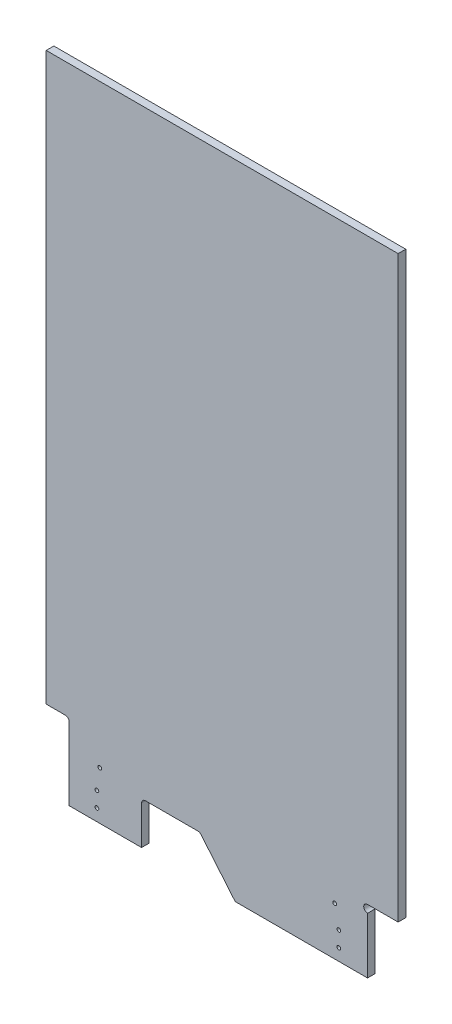
ISO-10303-21;
HEADER;
FILE_DESCRIPTION(('STEP AP214'),'2;1');
FILE_NAME('part.step','',(''),(''),'','','');
FILE_SCHEMA(('AUTOMOTIVE_DESIGN { 1 0 10303 214 1 1 1 1 }'));
ENDSEC;
DATA;
#1=APPLICATION_CONTEXT('core data for automotive mechanical design processes');
#2=APPLICATION_PROTOCOL_DEFINITION('international standard','automotive_design',2000,#1);
#3=PRODUCT_CONTEXT('',#1,'mechanical');
#4=PRODUCT('Part','Part','',(#3));
#5=PRODUCT_RELATED_PRODUCT_CATEGORY('part','',(#4));
#6=PRODUCT_DEFINITION_FORMATION('','',#4);
#7=PRODUCT_DEFINITION_CONTEXT('part definition',#1,'design');
#8=PRODUCT_DEFINITION('design','',#6,#7);
#9=PRODUCT_DEFINITION_SHAPE('','',#8);
#10=(LENGTH_UNIT() NAMED_UNIT(*) SI_UNIT(.MILLI.,.METRE.));
#11=(NAMED_UNIT(*) PLANE_ANGLE_UNIT() SI_UNIT($,.RADIAN.));
#12=(NAMED_UNIT(*) SI_UNIT($,.STERADIAN.) SOLID_ANGLE_UNIT());
#13=UNCERTAINTY_MEASURE_WITH_UNIT(LENGTH_MEASURE(1.E-05),#10,'distance_accuracy_value','');
#14=(GEOMETRIC_REPRESENTATION_CONTEXT(3) GLOBAL_UNCERTAINTY_ASSIGNED_CONTEXT((#13)) GLOBAL_UNIT_ASSIGNED_CONTEXT((#10,
#11,#12)) REPRESENTATION_CONTEXT('',''));
#15=CARTESIAN_POINT('',(0.,0.,0.));
#16=DIRECTION('',(0.,0.,1.));
#17=DIRECTION('',(1.,0.,0.));
#18=AXIS2_PLACEMENT_3D('',#15,#16,#17);
#19=CARTESIAN_POINT('',(0.,0.,-12.7));
#20=DIRECTION('',(0.,-1.,0.));
#21=DIRECTION('',(0.,0.,-1.));
#22=AXIS2_PLACEMENT_3D('',#19,#20,#21);
#23=PLANE('',#22);
#24=DIRECTION('',(0.,0.,1.));
#25=VECTOR('',#24,1.);
#26=CARTESIAN_POINT('',(313.74877856418,0.,-183.341668485135));
#27=LINE('',#26,#25);
#28=CARTESIAN_POINT('',(313.74877856418,0.,-12.7));
#29=VERTEX_POINT('',#28);
#30=CARTESIAN_POINT('',(313.74877856418,0.,0.));
#31=VERTEX_POINT('',#30);
#32=EDGE_CURVE('E189',#29,#31,#27,.T.);
#33=ORIENTED_EDGE('',*,*,#32,.F.);
#34=DIRECTION('',(1.,0.,0.));
#35=VECTOR('',#34,1.);
#36=CARTESIAN_POINT('',(0.,0.,-12.7));
#37=LINE('',#36,#35);
#38=CARTESIAN_POINT('',(533.4,0.,-12.7));
#39=VERTEX_POINT('',#38);
#40=EDGE_CURVE('E169',#29,#39,#37,.T.);
#41=ORIENTED_EDGE('',*,*,#40,.T.);
#42=DIRECTION('',(0.,0.,1.));
#43=VECTOR('',#42,1.);
#44=CARTESIAN_POINT('',(533.4,0.,-132.940834083102));
#45=LINE('',#44,#43);
#46=CARTESIAN_POINT('',(533.4,0.,0.));
#47=VERTEX_POINT('',#46);
#48=EDGE_CURVE('E207',#39,#47,#45,.T.);
#49=ORIENTED_EDGE('',*,*,#48,.T.);
#50=DIRECTION('',(1.,0.,0.));
#51=VECTOR('',#50,1.);
#52=CARTESIAN_POINT('',(0.,0.,0.));
#53=LINE('',#52,#51);
#54=EDGE_CURVE('E298',#31,#47,#53,.T.);
#55=ORIENTED_EDGE('',*,*,#54,.F.);
#56=EDGE_LOOP('',(#33,#41,#49,#55));
#57=FACE_BOUND('',#56,.T.);
#58=ADVANCED_FACE('F31',(#57),#23,.T.);
#59=CARTESIAN_POINT('',(584.2,1066.8,-12.7));
#60=DIRECTION('',(0.,1.,0.));
#61=DIRECTION('',(0.,0.,1.));
#62=AXIS2_PLACEMENT_3D('',#59,#60,#61);
#63=PLANE('',#62);
#64=DIRECTION('',(-1.,0.,0.));
#65=VECTOR('',#64,1.);
#66=CARTESIAN_POINT('',(584.2,1066.8,0.));
#67=LINE('',#66,#65);
#68=CARTESIAN_POINT('',(584.2,1066.8,0.));
#69=VERTEX_POINT('',#68);
#70=CARTESIAN_POINT('',(-1.30641005825771E-13,1066.8,0.));
#71=VERTEX_POINT('',#70);
#72=EDGE_CURVE('E280',#69,#71,#67,.T.);
#73=ORIENTED_EDGE('',*,*,#72,.F.);
#74=DIRECTION('',(0.,0.,1.));
#75=VECTOR('',#74,1.);
#76=CARTESIAN_POINT('',(584.2,1066.8,-12.7));
#77=LINE('',#76,#75);
#78=CARTESIAN_POINT('',(584.2,1066.8,-12.7));
#79=VERTEX_POINT('',#78);
#80=EDGE_CURVE('E11',#79,#69,#77,.T.);
#81=ORIENTED_EDGE('',*,*,#80,.F.);
#82=DIRECTION('',(-1.,0.,0.));
#83=VECTOR('',#82,1.);
#84=CARTESIAN_POINT('',(584.2,1066.8,-12.7));
#85=LINE('',#84,#83);
#86=CARTESIAN_POINT('',(-1.30641005825771E-13,1066.8,-12.7));
#87=VERTEX_POINT('',#86);
#88=EDGE_CURVE('E281',#79,#87,#85,.T.);
#89=ORIENTED_EDGE('',*,*,#88,.T.);
#90=DIRECTION('',(0.,0.,1.));
#91=VECTOR('',#90,1.);
#92=CARTESIAN_POINT('',(-1.30641005825771E-13,1066.8,-12.7));
#93=LINE('',#92,#91);
#94=EDGE_CURVE('E35',#87,#71,#93,.T.);
#95=ORIENTED_EDGE('',*,*,#94,.T.);
#96=EDGE_LOOP('',(#73,#81,#89,#95));
#97=FACE_BOUND('',#96,.T.);
#98=ADVANCED_FACE('F33',(#97),#63,.T.);
#99=CARTESIAN_POINT('',(584.2,0.,-12.7));
#100=DIRECTION('',(1.,0.,0.));
#101=DIRECTION('',(0.,1.,0.));
#102=AXIS2_PLACEMENT_3D('',#99,#100,#101);
#103=PLANE('',#102);
#104=DIRECTION('',(0.,0.,1.));
#105=VECTOR('',#104,1.);
#106=CARTESIAN_POINT('',(584.2,105.791,-132.940834083102));
#107=LINE('',#106,#105);
#108=CARTESIAN_POINT('',(584.2,105.791,-12.7));
#109=VERTEX_POINT('',#108);
#110=CARTESIAN_POINT('',(584.2,105.791,0.));
#111=VERTEX_POINT('',#110);
#112=EDGE_CURVE('E214',#109,#111,#107,.T.);
#113=ORIENTED_EDGE('',*,*,#112,.F.);
#114=DIRECTION('',(0.,1.,0.));
#115=VECTOR('',#114,1.);
#116=CARTESIAN_POINT('',(584.2,0.,-12.7));
#117=LINE('',#116,#115);
#118=EDGE_CURVE('E291',#109,#79,#117,.T.);
#119=ORIENTED_EDGE('',*,*,#118,.T.);
#120=ORIENTED_EDGE('',*,*,#80,.T.);
#121=DIRECTION('',(0.,1.,0.));
#122=VECTOR('',#121,1.);
#123=CARTESIAN_POINT('',(584.2,0.,0.));
#124=LINE('',#123,#122);
#125=EDGE_CURVE('E285',#111,#69,#124,.T.);
#126=ORIENTED_EDGE('',*,*,#125,.F.);
#127=EDGE_LOOP('',(#113,#119,#120,#126));
#128=FACE_BOUND('',#127,.T.);
#129=ADVANCED_FACE('F310',(#128),#103,.T.);
#130=DIRECTION('',(0.,0.,1.));
#131=VECTOR('',#130,1.);
#132=CARTESIAN_POINT('',(158.32633710844,0.,-183.341668485135));
#133=LINE('',#132,#131);
#134=CARTESIAN_POINT('',(158.32633710844,0.,-12.7));
#135=VERTEX_POINT('',#134);
#136=CARTESIAN_POINT('',(158.32633710844,0.,0.));
#137=VERTEX_POINT('',#136);
#138=EDGE_CURVE('E179',#135,#137,#133,.T.);
#139=ORIENTED_EDGE('',*,*,#138,.T.);
#140=CARTESIAN_POINT('',(38.0999999999999,0.,0.));
#141=VERTEX_POINT('',#140);
#142=EDGE_CURVE('E299',#141,#137,#53,.T.);
#143=ORIENTED_EDGE('',*,*,#142,.F.);
#144=DIRECTION('',(0.,0.,1.));
#145=VECTOR('',#144,1.);
#146=CARTESIAN_POINT('',(38.0999999999999,0.,-145.291892663164));
#147=LINE('',#146,#145);
#148=CARTESIAN_POINT('',(38.0999999999999,0.,-12.7));
#149=VERTEX_POINT('',#148);
#150=EDGE_CURVE('E221',#149,#141,#147,.T.);
#151=ORIENTED_EDGE('',*,*,#150,.F.);
#152=EDGE_CURVE('E288',#149,#135,#37,.T.);
#153=ORIENTED_EDGE('',*,*,#152,.T.);
#154=EDGE_LOOP('',(#139,#143,#151,#153));
#155=FACE_BOUND('',#154,.T.);
#156=ADVANCED_FACE('F333',(#155),#23,.T.);
#157=CARTESIAN_POINT('',(-1.30641005825771E-13,1066.8,-12.7));
#158=DIRECTION('',(-1.,0.,0.));
#159=DIRECTION('',(0.,-1.,0.));
#160=AXIS2_PLACEMENT_3D('',#157,#158,#159);
#161=PLANE('',#160);
#162=DIRECTION('',(0.,0.,1.));
#163=VECTOR('',#162,1.);
#164=CARTESIAN_POINT('',(-1.45716771982052E-13,127.,-145.291892663164));
#165=LINE('',#164,#163);
#166=CARTESIAN_POINT('',(-1.45716771982052E-13,127.,-12.7));
#167=VERTEX_POINT('',#166);
#168=CARTESIAN_POINT('',(-1.45716771982052E-13,127.,0.));
#169=VERTEX_POINT('',#168);
#170=EDGE_CURVE('E229',#167,#169,#165,.T.);
#171=ORIENTED_EDGE('',*,*,#170,.T.);
#172=DIRECTION('',(0.,-1.,0.));
#173=VECTOR('',#172,1.);
#174=CARTESIAN_POINT('',(-1.30641005825771E-13,1066.8,0.));
#175=LINE('',#174,#173);
#176=EDGE_CURVE('E295',#71,#169,#175,.T.);
#177=ORIENTED_EDGE('',*,*,#176,.F.);
#178=ORIENTED_EDGE('',*,*,#94,.F.);
#179=DIRECTION('',(0.,-1.,0.));
#180=VECTOR('',#179,1.);
#181=CARTESIAN_POINT('',(-1.30641005825771E-13,1066.8,-12.7));
#182=LINE('',#181,#180);
#183=EDGE_CURVE('E284',#87,#167,#182,.T.);
#184=ORIENTED_EDGE('',*,*,#183,.T.);
#185=EDGE_LOOP('',(#171,#177,#178,#184));
#186=FACE_BOUND('',#185,.T.);
#187=ADVANCED_FACE('F317',(#186),#161,.T.);
#188=CARTESIAN_POINT('',(584.2,1066.8,-12.7));
#189=DIRECTION('',(0.,0.,-1.));
#190=DIRECTION('',(-1.,0.,0.));
#191=AXIS2_PLACEMENT_3D('',#188,#189,#190);
#192=PLANE('',#191);
#193=DIRECTION('',(-0.641310019725374,0.767281863854373,0.));
#194=VECTOR('',#193,1.);
#195=CARTESIAN_POINT('',(256.77344876348,68.16693315024,-12.7));
#196=LINE('',#195,#194);
#197=CARTESIAN_POINT('',(256.77344876348,68.16693315024,-12.7));
#198=VERTEX_POINT('',#197);
#199=EDGE_CURVE('E159',#29,#198,#196,.T.);
#200=ORIENTED_EDGE('',*,*,#199,.T.);
#201=CARTESIAN_POINT('',(251.90120892962,64.0946145235774,-12.7));
#202=DIRECTION('',(0.,0.,-1.));
#203=DIRECTION('',(-1.,0.,0.));
#204=AXIS2_PLACEMENT_3D('',#201,#202,#203);
#205=CIRCLE('',#204,6.3499999996626);
#206=CARTESIAN_POINT('',(251.90120892962,70.44461452324,-12.7));
#207=VERTEX_POINT('',#206);
#208=EDGE_CURVE('E146',#198,#207,#205,.F.);
#209=ORIENTED_EDGE('',*,*,#208,.T.);
#210=DIRECTION('',(-1.,0.,0.));
#211=VECTOR('',#210,1.);
#212=CARTESIAN_POINT('',(164.67633710844,70.44461452324,-12.7));
#213=LINE('',#212,#211);
#214=CARTESIAN_POINT('',(164.67633710844,70.44461452324,-12.7));
#215=VERTEX_POINT('',#214);
#216=EDGE_CURVE('E185',#207,#215,#213,.T.);
#217=ORIENTED_EDGE('',*,*,#216,.T.);
#218=CARTESIAN_POINT('',(164.67633710844,64.09461452324,-12.7));
#219=DIRECTION('',(0.,0.,-1.));
#220=DIRECTION('',(-1.,0.,0.));
#221=AXIS2_PLACEMENT_3D('',#218,#219,#220);
#222=CIRCLE('',#221,6.34999999999999);
#223=CARTESIAN_POINT('',(158.32633710844,64.09461452324,-12.7));
#224=VERTEX_POINT('',#223);
#225=EDGE_CURVE('E181',#215,#224,#222,.F.);
#226=ORIENTED_EDGE('',*,*,#225,.T.);
#227=DIRECTION('',(0.,-1.,0.));
#228=VECTOR('',#227,1.);
#229=CARTESIAN_POINT('',(158.32633710844,0.,-12.7));
#230=LINE('',#229,#228);
#231=EDGE_CURVE('E176',#224,#135,#230,.T.);
#232=ORIENTED_EDGE('',*,*,#231,.T.);
#233=ORIENTED_EDGE('',*,*,#152,.F.);
#234=DIRECTION('',(0.,1.,0.));
#235=VECTOR('',#234,1.);
#236=CARTESIAN_POINT('',(38.0999999999999,120.65,-12.7));
#237=LINE('',#236,#235);
#238=CARTESIAN_POINT('',(38.0999999999999,120.65,-12.7));
#239=VERTEX_POINT('',#238);
#240=EDGE_CURVE('E235',#149,#239,#237,.T.);
#241=ORIENTED_EDGE('',*,*,#240,.T.);
#242=CARTESIAN_POINT('',(31.7499999999999,120.65,-12.7));
#243=DIRECTION('',(0.,0.,-1.));
#244=DIRECTION('',(-1.,0.,0.));
#245=AXIS2_PLACEMENT_3D('',#242,#243,#244);
#246=CIRCLE('',#245,6.34999999999998);
#247=CARTESIAN_POINT('',(31.7499999999999,127.,-12.7));
#248=VERTEX_POINT('',#247);
#249=EDGE_CURVE('E231',#239,#248,#246,.F.);
#250=ORIENTED_EDGE('',*,*,#249,.T.);
#251=DIRECTION('',(-1.,0.,0.));
#252=VECTOR('',#251,1.);
#253=CARTESIAN_POINT('',(-1.45716771982052E-13,127.,-12.7));
#254=LINE('',#253,#252);
#255=EDGE_CURVE('E226',#248,#167,#254,.T.);
#256=ORIENTED_EDGE('',*,*,#255,.T.);
#257=ORIENTED_EDGE('',*,*,#183,.F.);
#258=ORIENTED_EDGE('',*,*,#88,.F.);
#259=ORIENTED_EDGE('',*,*,#118,.F.);
#260=DIRECTION('',(-1.,0.,0.));
#261=VECTOR('',#260,1.);
#262=CARTESIAN_POINT('',(584.2,105.791,-12.7));
#263=LINE('',#262,#261);
#264=CARTESIAN_POINT('',(533.4,105.791,-12.7));
#265=VERTEX_POINT('',#264);
#266=EDGE_CURVE('E198',#109,#265,#263,.T.);
#267=ORIENTED_EDGE('',*,*,#266,.T.);
#268=CARTESIAN_POINT('',(533.4,99.441,-12.7));
#269=DIRECTION('',(0.,0.,-1.));
#270=DIRECTION('',(-1.,0.,0.));
#271=AXIS2_PLACEMENT_3D('',#268,#269,#270);
#272=CIRCLE('',#271,6.35000000000001);
#273=CARTESIAN_POINT('',(533.4,93.091,-12.7));
#274=VERTEX_POINT('',#273);
#275=EDGE_CURVE('E209',#265,#274,#272,.F.);
#276=ORIENTED_EDGE('',*,*,#275,.T.);
#277=DIRECTION('',(0.,-1.,0.));
#278=VECTOR('',#277,1.);
#279=CARTESIAN_POINT('',(533.4,93.091,-12.7));
#280=LINE('',#279,#278);
#281=EDGE_CURVE('E205',#274,#39,#280,.T.);
#282=ORIENTED_EDGE('',*,*,#281,.T.);
#283=ORIENTED_EDGE('',*,*,#40,.F.);
#284=EDGE_LOOP('',(#200,#209,#217,#226,#232,#233,#241,#250,#256,#257,#258,#259,#267,#276,#282,#283));
#285=FACE_BOUND('',#284,.T.);
#286=CARTESIAN_POINT('',(478.78860572796,80.137,-12.7));
#287=DIRECTION('',(0.,0.,-1.));
#288=DIRECTION('',(-1.,0.,0.));
#289=AXIS2_PLACEMENT_3D('',#286,#287,#288);
#290=CIRCLE('',#289,3.11149999999999);
#291=CARTESIAN_POINT('',(475.67710572796,80.137,-12.7));
#292=VERTEX_POINT('',#291);
#293=EDGE_CURVE('E247',#292,#292,#290,.F.);
#294=ORIENTED_EDGE('',*,*,#293,.T.);
#295=EDGE_LOOP('',(#294));
#296=FACE_BOUND('',#295,.T.);
#297=CARTESIAN_POINT('',(485.77360572796,45.212,-12.7));
#298=DIRECTION('',(0.,0.,-1.));
#299=DIRECTION('',(-1.,0.,0.));
#300=AXIS2_PLACEMENT_3D('',#297,#298,#299);
#301=CIRCLE('',#300,3.11149999999999);
#302=CARTESIAN_POINT('',(482.66210572796,45.212,-12.7));
#303=VERTEX_POINT('',#302);
#304=EDGE_CURVE('E253',#303,#303,#301,.F.);
#305=ORIENTED_EDGE('',*,*,#304,.T.);
#306=EDGE_LOOP('',(#305));
#307=FACE_BOUND('',#306,.T.);
#308=CARTESIAN_POINT('',(485.77360572796,19.812,-12.7));
#309=DIRECTION('',(0.,0.,-1.));
#310=DIRECTION('',(-1.,0.,0.));
#311=AXIS2_PLACEMENT_3D('',#308,#309,#310);
#312=CIRCLE('',#311,3.11149999999999);
#313=CARTESIAN_POINT('',(482.66210572796,19.812,-12.7));
#314=VERTEX_POINT('',#313);
#315=EDGE_CURVE('E259',#314,#314,#312,.F.);
#316=ORIENTED_EDGE('',*,*,#315,.T.);
#317=EDGE_LOOP('',(#316));
#318=FACE_BOUND('',#317,.T.);
#319=CARTESIAN_POINT('',(88.89860572796,80.137,-12.7));
#320=DIRECTION('',(0.,0.,-1.));
#321=DIRECTION('',(-1.,0.,0.));
#322=AXIS2_PLACEMENT_3D('',#319,#320,#321);
#323=CIRCLE('',#322,3.1115);
#324=CARTESIAN_POINT('',(85.78710572796,80.137,-12.7));
#325=VERTEX_POINT('',#324);
#326=EDGE_CURVE('E265',#325,#325,#323,.F.);
#327=ORIENTED_EDGE('',*,*,#326,.T.);
#328=EDGE_LOOP('',(#327));
#329=FACE_BOUND('',#328,.T.);
#330=CARTESIAN_POINT('',(84.13610572796,45.212,-12.7));
#331=DIRECTION('',(0.,0.,-1.));
#332=DIRECTION('',(-1.,0.,0.));
#333=AXIS2_PLACEMENT_3D('',#330,#331,#332);
#334=CIRCLE('',#333,3.1115);
#335=CARTESIAN_POINT('',(81.02460572796,45.212,-12.7));
#336=VERTEX_POINT('',#335);
#337=EDGE_CURVE('E271',#336,#336,#334,.F.);
#338=ORIENTED_EDGE('',*,*,#337,.T.);
#339=EDGE_LOOP('',(#338));
#340=FACE_BOUND('',#339,.T.);
#341=CARTESIAN_POINT('',(84.13610572796,19.812,-12.7));
#342=DIRECTION('',(0.,0.,-1.));
#343=DIRECTION('',(-1.,0.,0.));
#344=AXIS2_PLACEMENT_3D('',#341,#342,#343);
#345=CIRCLE('',#344,3.1115);
#346=CARTESIAN_POINT('',(81.02460572796,19.812,-12.7));
#347=VERTEX_POINT('',#346);
#348=EDGE_CURVE('E277',#347,#347,#345,.F.);
#349=ORIENTED_EDGE('',*,*,#348,.T.);
#350=EDGE_LOOP('',(#349));
#351=FACE_BOUND('',#350,.T.);
#352=ADVANCED_FACE('F166',(#285,#296,#307,#318,#329,#340,#351),#192,.T.);
#353=CARTESIAN_POINT('',(584.2,1066.8,0.));
#354=DIRECTION('',(0.,0.,-1.));
#355=DIRECTION('',(-1.,0.,0.));
#356=AXIS2_PLACEMENT_3D('',#353,#354,#355);
#357=PLANE('',#356);
#358=CARTESIAN_POINT('',(478.78860572796,80.137,0.));
#359=DIRECTION('',(0.,0.,1.));
#360=DIRECTION('',(1.,0.,0.));
#361=AXIS2_PLACEMENT_3D('',#358,#359,#360);
#362=CIRCLE('',#361,3.11149999999999);
#363=CARTESIAN_POINT('',(481.90010572796,80.137,0.));
#364=VERTEX_POINT('',#363);
#365=EDGE_CURVE('E240',#364,#364,#362,.T.);
#366=ORIENTED_EDGE('',*,*,#365,.F.);
#367=EDGE_LOOP('',(#366));
#368=FACE_BOUND('',#367,.T.);
#369=CARTESIAN_POINT('',(485.77360572796,45.212,0.));
#370=DIRECTION('',(0.,0.,1.));
#371=DIRECTION('',(1.,0.,0.));
#372=AXIS2_PLACEMENT_3D('',#369,#370,#371);
#373=CIRCLE('',#372,3.11149999999999);
#374=CARTESIAN_POINT('',(488.88510572796,45.212,0.));
#375=VERTEX_POINT('',#374);
#376=EDGE_CURVE('E250',#375,#375,#373,.T.);
#377=ORIENTED_EDGE('',*,*,#376,.F.);
#378=EDGE_LOOP('',(#377));
#379=FACE_BOUND('',#378,.T.);
#380=CARTESIAN_POINT('',(485.77360572796,19.812,0.));
#381=DIRECTION('',(0.,0.,1.));
#382=DIRECTION('',(1.,0.,0.));
#383=AXIS2_PLACEMENT_3D('',#380,#381,#382);
#384=CIRCLE('',#383,3.11149999999999);
#385=CARTESIAN_POINT('',(488.88510572796,19.812,0.));
#386=VERTEX_POINT('',#385);
#387=EDGE_CURVE('E256',#386,#386,#384,.T.);
#388=ORIENTED_EDGE('',*,*,#387,.F.);
#389=EDGE_LOOP('',(#388));
#390=FACE_BOUND('',#389,.T.);
#391=CARTESIAN_POINT('',(88.89860572796,80.137,0.));
#392=DIRECTION('',(0.,0.,1.));
#393=DIRECTION('',(1.,0.,0.));
#394=AXIS2_PLACEMENT_3D('',#391,#392,#393);
#395=CIRCLE('',#394,3.1115);
#396=CARTESIAN_POINT('',(92.01010572796,80.137,0.));
#397=VERTEX_POINT('',#396);
#398=EDGE_CURVE('E262',#397,#397,#395,.T.);
#399=ORIENTED_EDGE('',*,*,#398,.F.);
#400=EDGE_LOOP('',(#399));
#401=FACE_BOUND('',#400,.T.);
#402=CARTESIAN_POINT('',(84.13610572796,45.212,0.));
#403=DIRECTION('',(0.,0.,1.));
#404=DIRECTION('',(1.,0.,0.));
#405=AXIS2_PLACEMENT_3D('',#402,#403,#404);
#406=CIRCLE('',#405,3.1115);
#407=CARTESIAN_POINT('',(87.24760572796,45.212,0.));
#408=VERTEX_POINT('',#407);
#409=EDGE_CURVE('E268',#408,#408,#406,.T.);
#410=ORIENTED_EDGE('',*,*,#409,.F.);
#411=EDGE_LOOP('',(#410));
#412=FACE_BOUND('',#411,.T.);
#413=CARTESIAN_POINT('',(84.13610572796,19.812,0.));
#414=DIRECTION('',(0.,0.,1.));
#415=DIRECTION('',(1.,0.,0.));
#416=AXIS2_PLACEMENT_3D('',#413,#414,#415);
#417=CIRCLE('',#416,3.1115);
#418=CARTESIAN_POINT('',(87.24760572796,19.812,0.));
#419=VERTEX_POINT('',#418);
#420=EDGE_CURVE('E274',#419,#419,#417,.T.);
#421=ORIENTED_EDGE('',*,*,#420,.F.);
#422=EDGE_LOOP('',(#421));
#423=FACE_BOUND('',#422,.T.);
#424=CARTESIAN_POINT('',(251.90120892962,64.0946145235774,0.));
#425=DIRECTION('',(0.,0.,1.));
#426=DIRECTION('',(-1.,0.,0.));
#427=AXIS2_PLACEMENT_3D('',#424,#425,#426);
#428=CIRCLE('',#427,6.3499999996626);
#429=CARTESIAN_POINT('',(256.77344876348,68.16693315024,0.));
#430=VERTEX_POINT('',#429);
#431=CARTESIAN_POINT('',(251.90120892962,70.44461452324,0.));
#432=VERTEX_POINT('',#431);
#433=EDGE_CURVE('E344',#430,#432,#428,.T.);
#434=ORIENTED_EDGE('',*,*,#433,.F.);
#435=DIRECTION('',(-0.641310019725374,0.767281863854372,0.));
#436=VECTOR('',#435,1.);
#437=CARTESIAN_POINT('',(256.77344876348,68.16693315024,0.));
#438=LINE('',#437,#436);
#439=EDGE_CURVE('E162',#31,#430,#438,.T.);
#440=ORIENTED_EDGE('',*,*,#439,.F.);
#441=ORIENTED_EDGE('',*,*,#54,.T.);
#442=DIRECTION('',(0.,-1.,0.));
#443=VECTOR('',#442,1.);
#444=CARTESIAN_POINT('',(533.4,93.091,0.));
#445=LINE('',#444,#443);
#446=CARTESIAN_POINT('',(533.4,93.0909999999999,0.));
#447=VERTEX_POINT('',#446);
#448=EDGE_CURVE('E195',#447,#47,#445,.T.);
#449=ORIENTED_EDGE('',*,*,#448,.F.);
#450=CARTESIAN_POINT('',(533.4,99.441,0.));
#451=DIRECTION('',(0.,0.,1.));
#452=DIRECTION('',(1.,0.,0.));
#453=AXIS2_PLACEMENT_3D('',#450,#451,#452);
#454=CIRCLE('',#453,6.35000000000001);
#455=CARTESIAN_POINT('',(533.4,105.791,0.));
#456=VERTEX_POINT('',#455);
#457=EDGE_CURVE('E54',#456,#447,#454,.T.);
#458=ORIENTED_EDGE('',*,*,#457,.F.);
#459=DIRECTION('',(-1.,0.,0.));
#460=VECTOR('',#459,1.);
#461=CARTESIAN_POINT('',(584.2,105.791,0.));
#462=LINE('',#461,#460);
#463=EDGE_CURVE('E194',#111,#456,#462,.T.);
#464=ORIENTED_EDGE('',*,*,#463,.F.);
#465=ORIENTED_EDGE('',*,*,#125,.T.);
#466=ORIENTED_EDGE('',*,*,#72,.T.);
#467=ORIENTED_EDGE('',*,*,#176,.T.);
#468=DIRECTION('',(-1.,0.,0.));
#469=VECTOR('',#468,1.);
#470=CARTESIAN_POINT('',(-1.45716771982052E-13,127.,0.));
#471=LINE('',#470,#469);
#472=CARTESIAN_POINT('',(31.7499999999998,127.,0.));
#473=VERTEX_POINT('',#472);
#474=EDGE_CURVE('E219',#473,#169,#471,.T.);
#475=ORIENTED_EDGE('',*,*,#474,.F.);
#476=CARTESIAN_POINT('',(31.7499999999999,120.65,0.));
#477=DIRECTION('',(0.,0.,1.));
#478=DIRECTION('',(-1.,0.,0.));
#479=AXIS2_PLACEMENT_3D('',#476,#477,#478);
#480=CIRCLE('',#479,6.34999999999998);
#481=CARTESIAN_POINT('',(38.0999999999998,120.65,0.));
#482=VERTEX_POINT('',#481);
#483=EDGE_CURVE('E222',#482,#473,#480,.T.);
#484=ORIENTED_EDGE('',*,*,#483,.F.);
#485=DIRECTION('',(0.,1.,0.));
#486=VECTOR('',#485,1.);
#487=CARTESIAN_POINT('',(38.0999999999999,120.65,0.));
#488=LINE('',#487,#486);
#489=EDGE_CURVE('E218',#141,#482,#488,.T.);
#490=ORIENTED_EDGE('',*,*,#489,.F.);
#491=ORIENTED_EDGE('',*,*,#142,.T.);
#492=DIRECTION('',(0.,-1.,0.));
#493=VECTOR('',#492,1.);
#494=CARTESIAN_POINT('',(158.32633710844,0.,0.));
#495=LINE('',#494,#493);
#496=CARTESIAN_POINT('',(158.32633710844,64.0946145232402,0.));
#497=VERTEX_POINT('',#496);
#498=EDGE_CURVE('E170',#497,#137,#495,.T.);
#499=ORIENTED_EDGE('',*,*,#498,.F.);
#500=CARTESIAN_POINT('',(164.67633710844,64.09461452324,0.));
#501=DIRECTION('',(0.,0.,1.));
#502=DIRECTION('',(-1.,0.,0.));
#503=AXIS2_PLACEMENT_3D('',#500,#501,#502);
#504=CIRCLE('',#503,6.34999999999999);
#505=CARTESIAN_POINT('',(164.67633710844,70.44461452324,0.));
#506=VERTEX_POINT('',#505);
#507=EDGE_CURVE('E46',#506,#497,#504,.T.);
#508=ORIENTED_EDGE('',*,*,#507,.F.);
#509=DIRECTION('',(-1.,0.,0.));
#510=VECTOR('',#509,1.);
#511=CARTESIAN_POINT('',(164.67633710844,70.44461452324,0.));
#512=LINE('',#511,#510);
#513=EDGE_CURVE('E343',#432,#506,#512,.T.);
#514=ORIENTED_EDGE('',*,*,#513,.F.);
#515=EDGE_LOOP('',(#434,#440,#441,#449,#458,#464,#465,#466,#467,#475,#484,#490,#491,#499,#508,#514));
#516=FACE_BOUND('',#515,.T.);
#517=ADVANCED_FACE('F305',(#368,#379,#390,#401,#412,#423,#516),#357,.F.);
#518=CARTESIAN_POINT('',(84.13610572796,19.812,-21.5006509986478));
#519=DIRECTION('',(0.,0.,1.));
#520=DIRECTION('',(1.,0.,0.));
#521=AXIS2_PLACEMENT_3D('',#518,#519,#520);
#522=CYLINDRICAL_SURFACE('',#521,3.1115);
#523=ORIENTED_EDGE('',*,*,#420,.T.);
#524=EDGE_LOOP('',(#523));
#525=FACE_BOUND('',#524,.T.);
#526=ORIENTED_EDGE('',*,*,#348,.F.);
#527=EDGE_LOOP('',(#526));
#528=FACE_BOUND('',#527,.T.);
#529=ADVANCED_FACE('F381',(#525,#528),#522,.F.);
#530=CARTESIAN_POINT('',(84.13610572796,45.212,-21.5006509986478));
#531=DIRECTION('',(0.,0.,1.));
#532=DIRECTION('',(1.,0.,0.));
#533=AXIS2_PLACEMENT_3D('',#530,#531,#532);
#534=CYLINDRICAL_SURFACE('',#533,3.1115);
#535=ORIENTED_EDGE('',*,*,#409,.T.);
#536=EDGE_LOOP('',(#535));
#537=FACE_BOUND('',#536,.T.);
#538=ORIENTED_EDGE('',*,*,#337,.F.);
#539=EDGE_LOOP('',(#538));
#540=FACE_BOUND('',#539,.T.);
#541=ADVANCED_FACE('F387',(#537,#540),#534,.F.);
#542=CARTESIAN_POINT('',(88.89860572796,80.137,-21.5006509986478));
#543=DIRECTION('',(0.,0.,1.));
#544=DIRECTION('',(1.,0.,0.));
#545=AXIS2_PLACEMENT_3D('',#542,#543,#544);
#546=CYLINDRICAL_SURFACE('',#545,3.1115);
#547=ORIENTED_EDGE('',*,*,#398,.T.);
#548=EDGE_LOOP('',(#547));
#549=FACE_BOUND('',#548,.T.);
#550=ORIENTED_EDGE('',*,*,#326,.F.);
#551=EDGE_LOOP('',(#550));
#552=FACE_BOUND('',#551,.T.);
#553=ADVANCED_FACE('F391',(#549,#552),#546,.F.);
#554=CARTESIAN_POINT('',(485.77360572796,19.812,-21.5006509986478));
#555=DIRECTION('',(0.,0.,1.));
#556=DIRECTION('',(1.,0.,0.));
#557=AXIS2_PLACEMENT_3D('',#554,#555,#556);
#558=CYLINDRICAL_SURFACE('',#557,3.11149999999999);
#559=ORIENTED_EDGE('',*,*,#387,.T.);
#560=EDGE_LOOP('',(#559));
#561=FACE_BOUND('',#560,.T.);
#562=ORIENTED_EDGE('',*,*,#315,.F.);
#563=EDGE_LOOP('',(#562));
#564=FACE_BOUND('',#563,.T.);
#565=ADVANCED_FACE('F395',(#561,#564),#558,.F.);
#566=CARTESIAN_POINT('',(485.77360572796,45.212,-21.5006509986478));
#567=DIRECTION('',(0.,0.,1.));
#568=DIRECTION('',(1.,0.,0.));
#569=AXIS2_PLACEMENT_3D('',#566,#567,#568);
#570=CYLINDRICAL_SURFACE('',#569,3.11149999999999);
#571=ORIENTED_EDGE('',*,*,#376,.T.);
#572=EDGE_LOOP('',(#571));
#573=FACE_BOUND('',#572,.T.);
#574=ORIENTED_EDGE('',*,*,#304,.F.);
#575=EDGE_LOOP('',(#574));
#576=FACE_BOUND('',#575,.T.);
#577=ADVANCED_FACE('F399',(#573,#576),#570,.F.);
#578=CARTESIAN_POINT('',(478.78860572796,80.137,-21.5006509986478));
#579=DIRECTION('',(0.,0.,1.));
#580=DIRECTION('',(1.,0.,0.));
#581=AXIS2_PLACEMENT_3D('',#578,#579,#580);
#582=CYLINDRICAL_SURFACE('',#581,3.11149999999999);
#583=ORIENTED_EDGE('',*,*,#365,.T.);
#584=EDGE_LOOP('',(#583));
#585=FACE_BOUND('',#584,.T.);
#586=ORIENTED_EDGE('',*,*,#293,.F.);
#587=EDGE_LOOP('',(#586));
#588=FACE_BOUND('',#587,.T.);
#589=ADVANCED_FACE('F403',(#585,#588),#582,.F.);
#590=CARTESIAN_POINT('',(38.0999999999999,120.65,-145.291892663164));
#591=DIRECTION('',(1.,0.,0.));
#592=DIRECTION('',(0.,1.,0.));
#593=AXIS2_PLACEMENT_3D('',#590,#591,#592);
#594=PLANE('',#593);
#595=ORIENTED_EDGE('',*,*,#150,.T.);
#596=ORIENTED_EDGE('',*,*,#489,.T.);
#597=DIRECTION('',(0.,0.,1.));
#598=VECTOR('',#597,1.);
#599=CARTESIAN_POINT('',(38.0999999999998,120.65,-145.291892663164));
#600=LINE('',#599,#598);
#601=EDGE_CURVE('E234',#239,#482,#600,.T.);
#602=ORIENTED_EDGE('',*,*,#601,.F.);
#603=ORIENTED_EDGE('',*,*,#240,.F.);
#604=EDGE_LOOP('',(#595,#596,#602,#603));
#605=FACE_BOUND('',#604,.T.);
#606=ADVANCED_FACE('F330',(#605),#594,.F.);
#607=CARTESIAN_POINT('',(31.7499999999999,120.65,-145.291892663164));
#608=DIRECTION('',(0.,0.,1.));
#609=DIRECTION('',(1.,0.,0.));
#610=AXIS2_PLACEMENT_3D('',#607,#608,#609);
#611=CYLINDRICAL_SURFACE('',#610,6.34999999999998);
#612=ORIENTED_EDGE('',*,*,#601,.T.);
#613=ORIENTED_EDGE('',*,*,#483,.T.);
#614=DIRECTION('',(0.,0.,1.));
#615=VECTOR('',#614,1.);
#616=CARTESIAN_POINT('',(31.7499999999999,127.,-145.291892663164));
#617=LINE('',#616,#615);
#618=EDGE_CURVE('E230',#248,#473,#617,.T.);
#619=ORIENTED_EDGE('',*,*,#618,.F.);
#620=ORIENTED_EDGE('',*,*,#249,.F.);
#621=EDGE_LOOP('',(#612,#613,#619,#620));
#622=FACE_BOUND('',#621,.T.);
#623=ADVANCED_FACE('F325',(#622),#611,.F.);
#624=CARTESIAN_POINT('',(-1.45716771982052E-13,127.,-145.291892663164));
#625=DIRECTION('',(0.,1.,0.));
#626=DIRECTION('',(-1.,0.,0.));
#627=AXIS2_PLACEMENT_3D('',#624,#625,#626);
#628=PLANE('',#627);
#629=ORIENTED_EDGE('',*,*,#618,.T.);
#630=ORIENTED_EDGE('',*,*,#474,.T.);
#631=ORIENTED_EDGE('',*,*,#170,.F.);
#632=ORIENTED_EDGE('',*,*,#255,.F.);
#633=EDGE_LOOP('',(#629,#630,#631,#632));
#634=FACE_BOUND('',#633,.T.);
#635=ADVANCED_FACE('F322',(#634),#628,.F.);
#636=CARTESIAN_POINT('',(584.2,105.791,-132.940834083102));
#637=DIRECTION('',(0.,1.,0.));
#638=DIRECTION('',(-1.,0.,0.));
#639=AXIS2_PLACEMENT_3D('',#636,#637,#638);
#640=PLANE('',#639);
#641=ORIENTED_EDGE('',*,*,#112,.T.);
#642=ORIENTED_EDGE('',*,*,#463,.T.);
#643=DIRECTION('',(0.,0.,1.));
#644=VECTOR('',#643,1.);
#645=CARTESIAN_POINT('',(533.4,105.791,-132.940834083102));
#646=LINE('',#645,#644);
#647=EDGE_CURVE('E204',#265,#456,#646,.T.);
#648=ORIENTED_EDGE('',*,*,#647,.F.);
#649=ORIENTED_EDGE('',*,*,#266,.F.);
#650=EDGE_LOOP('',(#641,#642,#648,#649));
#651=FACE_BOUND('',#650,.T.);
#652=ADVANCED_FACE('F356',(#651),#640,.F.);
#653=CARTESIAN_POINT('',(533.4,99.441,-132.940834083102));
#654=DIRECTION('',(0.,0.,1.));
#655=DIRECTION('',(1.,0.,0.));
#656=AXIS2_PLACEMENT_3D('',#653,#654,#655);
#657=CYLINDRICAL_SURFACE('',#656,6.35000000000001);
#658=ORIENTED_EDGE('',*,*,#647,.T.);
#659=ORIENTED_EDGE('',*,*,#457,.T.);
#660=DIRECTION('',(0.,0.,1.));
#661=VECTOR('',#660,1.);
#662=CARTESIAN_POINT('',(533.4,93.091,-132.940834083102));
#663=LINE('',#662,#661);
#664=EDGE_CURVE('E208',#274,#447,#663,.T.);
#665=ORIENTED_EDGE('',*,*,#664,.F.);
#666=ORIENTED_EDGE('',*,*,#275,.F.);
#667=EDGE_LOOP('',(#658,#659,#665,#666));
#668=FACE_BOUND('',#667,.T.);
#669=ADVANCED_FACE('F354',(#668),#657,.F.);
#670=CARTESIAN_POINT('',(533.4,93.091,-132.940834083102));
#671=DIRECTION('',(-1.,0.,0.));
#672=DIRECTION('',(0.,0.,1.));
#673=AXIS2_PLACEMENT_3D('',#670,#671,#672);
#674=PLANE('',#673);
#675=ORIENTED_EDGE('',*,*,#664,.T.);
#676=ORIENTED_EDGE('',*,*,#448,.T.);
#677=ORIENTED_EDGE('',*,*,#48,.F.);
#678=ORIENTED_EDGE('',*,*,#281,.F.);
#679=EDGE_LOOP('',(#675,#676,#677,#678));
#680=FACE_BOUND('',#679,.T.);
#681=ADVANCED_FACE('F352',(#680),#674,.F.);
#682=CARTESIAN_POINT('',(256.77344876348,68.16693315024,-183.341668485135));
#683=DIRECTION('',(0.767281863854373,0.641310019725374,0.));
#684=DIRECTION('',(-0.641310019725374,0.767281863854373,0.));
#685=AXIS2_PLACEMENT_3D('',#682,#683,#684);
#686=PLANE('',#685);
#687=ORIENTED_EDGE('',*,*,#32,.T.);
#688=ORIENTED_EDGE('',*,*,#439,.T.);
#689=DIRECTION('',(0.,0.,1.));
#690=VECTOR('',#689,1.);
#691=CARTESIAN_POINT('',(256.77344876348,68.16693315024,-183.341668485135));
#692=LINE('',#691,#690);
#693=EDGE_CURVE('E150',#198,#430,#692,.T.);
#694=ORIENTED_EDGE('',*,*,#693,.F.);
#695=ORIENTED_EDGE('',*,*,#199,.F.);
#696=EDGE_LOOP('',(#687,#688,#694,#695));
#697=FACE_BOUND('',#696,.T.);
#698=ADVANCED_FACE('F158',(#697),#686,.F.);
#699=CARTESIAN_POINT('',(251.90120892962,64.0946145235774,-183.341668485135));
#700=DIRECTION('',(0.,0.,1.));
#701=DIRECTION('',(1.,0.,0.));
#702=AXIS2_PLACEMENT_3D('',#699,#700,#701);
#703=CYLINDRICAL_SURFACE('',#702,6.3499999996626);
#704=ORIENTED_EDGE('',*,*,#693,.T.);
#705=ORIENTED_EDGE('',*,*,#433,.T.);
#706=DIRECTION('',(0.,0.,1.));
#707=VECTOR('',#706,1.);
#708=CARTESIAN_POINT('',(251.90120892962,70.44461452324,-183.341668485135));
#709=LINE('',#708,#707);
#710=EDGE_CURVE('E152',#207,#432,#709,.T.);
#711=ORIENTED_EDGE('',*,*,#710,.F.);
#712=ORIENTED_EDGE('',*,*,#208,.F.);
#713=EDGE_LOOP('',(#704,#705,#711,#712));
#714=FACE_BOUND('',#713,.T.);
#715=ADVANCED_FACE('F148',(#714),#703,.F.);
#716=CARTESIAN_POINT('',(164.67633710844,70.44461452324,-183.341668485135));
#717=DIRECTION('',(0.,1.,0.));
#718=DIRECTION('',(0.,0.,1.));
#719=AXIS2_PLACEMENT_3D('',#716,#717,#718);
#720=PLANE('',#719);
#721=ORIENTED_EDGE('',*,*,#710,.T.);
#722=ORIENTED_EDGE('',*,*,#513,.T.);
#723=DIRECTION('',(0.,0.,1.));
#724=VECTOR('',#723,1.);
#725=CARTESIAN_POINT('',(164.67633710844,70.44461452324,-183.341668485135));
#726=LINE('',#725,#724);
#727=EDGE_CURVE('E184',#215,#506,#726,.T.);
#728=ORIENTED_EDGE('',*,*,#727,.F.);
#729=ORIENTED_EDGE('',*,*,#216,.F.);
#730=EDGE_LOOP('',(#721,#722,#728,#729));
#731=FACE_BOUND('',#730,.T.);
#732=ADVANCED_FACE('F341',(#731),#720,.F.);
#733=CARTESIAN_POINT('',(164.67633710844,64.09461452324,-183.341668485135));
#734=DIRECTION('',(0.,0.,1.));
#735=DIRECTION('',(1.,0.,0.));
#736=AXIS2_PLACEMENT_3D('',#733,#734,#735);
#737=CYLINDRICAL_SURFACE('',#736,6.34999999999999);
#738=ORIENTED_EDGE('',*,*,#727,.T.);
#739=ORIENTED_EDGE('',*,*,#507,.T.);
#740=DIRECTION('',(0.,0.,1.));
#741=VECTOR('',#740,1.);
#742=CARTESIAN_POINT('',(158.32633710844,64.09461452324,-183.341668485135));
#743=LINE('',#742,#741);
#744=EDGE_CURVE('E180',#224,#497,#743,.T.);
#745=ORIENTED_EDGE('',*,*,#744,.F.);
#746=ORIENTED_EDGE('',*,*,#225,.F.);
#747=EDGE_LOOP('',(#738,#739,#745,#746));
#748=FACE_BOUND('',#747,.T.);
#749=ADVANCED_FACE('F338',(#748),#737,.F.);
#750=CARTESIAN_POINT('',(158.32633710844,0.,-183.341668485135));
#751=DIRECTION('',(-1.,0.,0.));
#752=DIRECTION('',(0.,0.,1.));
#753=AXIS2_PLACEMENT_3D('',#750,#751,#752);
#754=PLANE('',#753);
#755=ORIENTED_EDGE('',*,*,#744,.T.);
#756=ORIENTED_EDGE('',*,*,#498,.T.);
#757=ORIENTED_EDGE('',*,*,#138,.F.);
#758=ORIENTED_EDGE('',*,*,#231,.F.);
#759=EDGE_LOOP('',(#755,#756,#757,#758));
#760=FACE_BOUND('',#759,.T.);
#761=ADVANCED_FACE('F337',(#760),#754,.F.);
#762=CLOSED_SHELL('',(#58,#98,#129,#156,#187,#352,#517,#529,#541,#553,#565,#577,#589,#606,#623,
#635,#652,#669,#681,#698,#715,#732,#749,#761));
#763=MANIFOLD_SOLID_BREP('B2',#762);
#764=ADVANCED_BREP_SHAPE_REPRESENTATION('',(#18,#763),#14);
#765=SHAPE_DEFINITION_REPRESENTATION(#9,#764);
ENDSEC;
END-ISO-10303-21;
